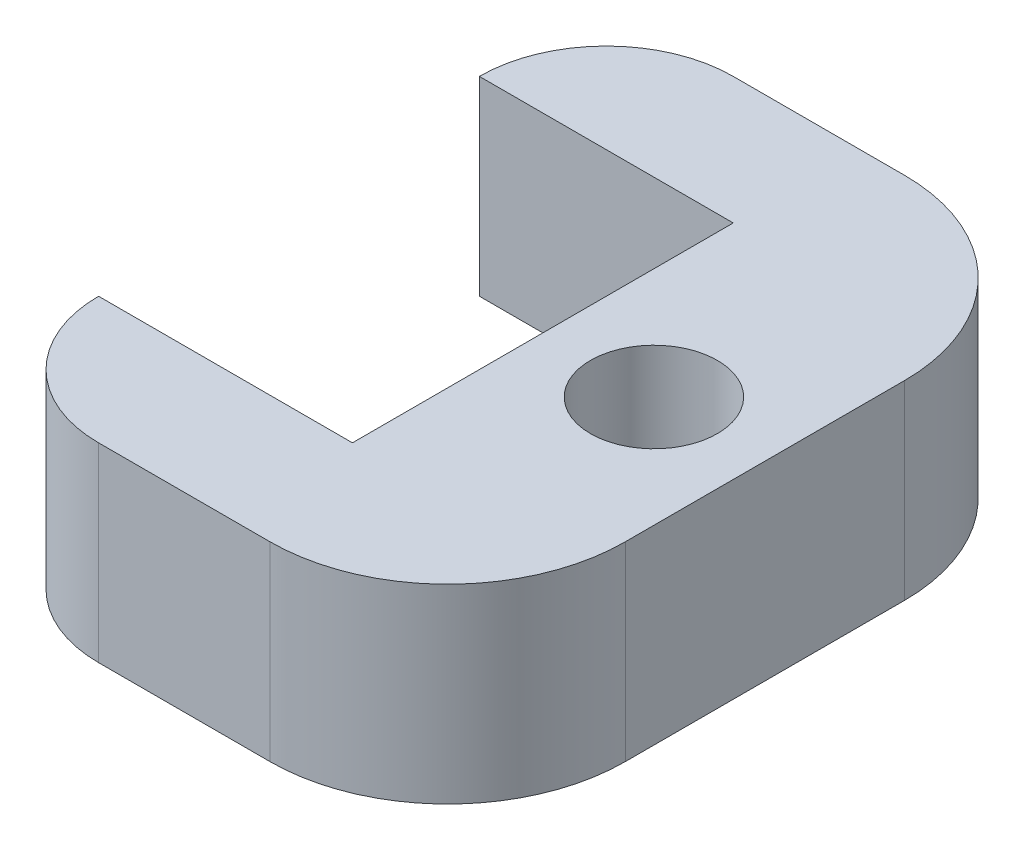
ISO-10303-21;
HEADER;
FILE_DESCRIPTION(('STEP AP214'),'2;1');
FILE_NAME('part.step','',(''),(''),'','','');
FILE_SCHEMA(('AUTOMOTIVE_DESIGN { 1 0 10303 214 1 1 1 1 }'));
ENDSEC;
DATA;
#1=APPLICATION_CONTEXT('core data for automotive mechanical design processes');
#2=APPLICATION_PROTOCOL_DEFINITION('international standard','automotive_design',2000,#1);
#3=PRODUCT_CONTEXT('',#1,'mechanical');
#4=PRODUCT('Part','Part','',(#3));
#5=PRODUCT_RELATED_PRODUCT_CATEGORY('part','',(#4));
#6=PRODUCT_DEFINITION_FORMATION('','',#4);
#7=PRODUCT_DEFINITION_CONTEXT('part definition',#1,'design');
#8=PRODUCT_DEFINITION('design','',#6,#7);
#9=PRODUCT_DEFINITION_SHAPE('','',#8);
#10=(LENGTH_UNIT() NAMED_UNIT(*) SI_UNIT(.MILLI.,.METRE.));
#11=(NAMED_UNIT(*) PLANE_ANGLE_UNIT() SI_UNIT($,.RADIAN.));
#12=(NAMED_UNIT(*) SI_UNIT($,.STERADIAN.) SOLID_ANGLE_UNIT());
#13=UNCERTAINTY_MEASURE_WITH_UNIT(LENGTH_MEASURE(1.E-05),#10,'distance_accuracy_value','');
#14=(GEOMETRIC_REPRESENTATION_CONTEXT(3) GLOBAL_UNCERTAINTY_ASSIGNED_CONTEXT((#13)) GLOBAL_UNIT_ASSIGNED_CONTEXT((#10,
#11,#12)) REPRESENTATION_CONTEXT('',''));
#15=CARTESIAN_POINT('',(0.,0.,0.));
#16=DIRECTION('',(0.,0.,1.));
#17=DIRECTION('',(1.,0.,0.));
#18=AXIS2_PLACEMENT_3D('',#15,#16,#17);
#19=CARTESIAN_POINT('',(-25.4,38.1,-38.1));
#20=DIRECTION('',(0.,-1.,0.));
#21=DIRECTION('',(0.,0.,-1.));
#22=AXIS2_PLACEMENT_3D('',#19,#20,#21);
#23=PLANE('',#22);
#24=DIRECTION('',(1.,0.,0.));
#25=VECTOR('',#24,1.);
#26=CARTESIAN_POINT('',(0.,38.1,-38.1));
#27=LINE('',#26,#25);
#28=CARTESIAN_POINT('',(-50.8,38.1,-38.1));
#29=VERTEX_POINT('',#28);
#30=CARTESIAN_POINT('',(0.,38.1,-38.1));
#31=VERTEX_POINT('',#30);
#32=EDGE_CURVE('E169',#29,#31,#27,.T.);
#33=ORIENTED_EDGE('',*,*,#32,.T.);
#34=DIRECTION('',(0.,0.,1.));
#35=VECTOR('',#34,1.);
#36=CARTESIAN_POINT('',(0.,38.1,38.1));
#37=LINE('',#36,#35);
#38=CARTESIAN_POINT('',(0.,38.1,38.1));
#39=VERTEX_POINT('',#38);
#40=EDGE_CURVE('E107',#31,#39,#37,.T.);
#41=ORIENTED_EDGE('',*,*,#40,.T.);
#42=DIRECTION('',(-1.,0.,0.));
#43=VECTOR('',#42,1.);
#44=CARTESIAN_POINT('',(0.,38.1,38.1));
#45=LINE('',#44,#43);
#46=CARTESIAN_POINT('',(-50.8,38.1,38.1));
#47=VERTEX_POINT('',#46);
#48=EDGE_CURVE('E190',#39,#47,#45,.T.);
#49=ORIENTED_EDGE('',*,*,#48,.T.);
#50=CARTESIAN_POINT('',(-25.4,38.1,38.1));
#51=DIRECTION('',(0.,1.,0.));
#52=DIRECTION('',(0.,0.,1.));
#53=AXIS2_PLACEMENT_3D('',#50,#51,#52);
#54=CIRCLE('',#53,25.4);
#55=CARTESIAN_POINT('',(-25.4,38.1,63.5));
#56=VERTEX_POINT('',#55);
#57=EDGE_CURVE('E209',#47,#56,#54,.T.);
#58=ORIENTED_EDGE('',*,*,#57,.T.);
#59=DIRECTION('',(1.,0.,0.));
#60=VECTOR('',#59,1.);
#61=CARTESIAN_POINT('',(-25.4,38.1,63.5));
#62=LINE('',#61,#60);
#63=CARTESIAN_POINT('',(8.88999999999975,38.1,63.5));
#64=VERTEX_POINT('',#63);
#65=EDGE_CURVE('E206',#56,#64,#62,.T.);
#66=ORIENTED_EDGE('',*,*,#65,.T.);
#67=CARTESIAN_POINT('',(8.89000000000001,38.1,27.94));
#68=DIRECTION('',(0.,1.,0.));
#69=DIRECTION('',(0.,0.,1.));
#70=AXIS2_PLACEMENT_3D('',#67,#68,#69);
#71=CIRCLE('',#70,35.56);
#72=CARTESIAN_POINT('',(44.45,38.1,27.9399999999998));
#73=VERTEX_POINT('',#72);
#74=EDGE_CURVE('E208',#64,#73,#71,.T.);
#75=ORIENTED_EDGE('',*,*,#74,.T.);
#76=DIRECTION('',(0.,0.,-1.));
#77=VECTOR('',#76,1.);
#78=CARTESIAN_POINT('',(44.45,38.1,-27.9399999999997));
#79=LINE('',#78,#77);
#80=CARTESIAN_POINT('',(44.45,38.1,-27.9399999999997));
#81=VERTEX_POINT('',#80);
#82=EDGE_CURVE('E132',#73,#81,#79,.T.);
#83=ORIENTED_EDGE('',*,*,#82,.T.);
#84=CARTESIAN_POINT('',(8.89000000000001,38.1,-27.94));
#85=DIRECTION('',(0.,1.,0.));
#86=DIRECTION('',(0.,0.,-1.));
#87=AXIS2_PLACEMENT_3D('',#84,#85,#86);
#88=CIRCLE('',#87,35.56);
#89=CARTESIAN_POINT('',(8.88999999999976,38.1,-63.5));
#90=VERTEX_POINT('',#89);
#91=EDGE_CURVE('E126',#81,#90,#88,.T.);
#92=ORIENTED_EDGE('',*,*,#91,.T.);
#93=DIRECTION('',(-1.,0.,0.));
#94=VECTOR('',#93,1.);
#95=CARTESIAN_POINT('',(-25.4,38.1,-63.5));
#96=LINE('',#95,#94);
#97=CARTESIAN_POINT('',(-25.4,38.1,-63.5));
#98=VERTEX_POINT('',#97);
#99=EDGE_CURVE('E130',#90,#98,#96,.T.);
#100=ORIENTED_EDGE('',*,*,#99,.T.);
#101=CARTESIAN_POINT('',(-25.4,38.1,-38.1));
#102=DIRECTION('',(0.,1.,0.));
#103=DIRECTION('',(0.,0.,-1.));
#104=AXIS2_PLACEMENT_3D('',#101,#102,#103);
#105=CIRCLE('',#104,25.4);
#106=EDGE_CURVE('E58',#98,#29,#105,.T.);
#107=ORIENTED_EDGE('',*,*,#106,.T.);
#108=EDGE_LOOP('',(#33,#41,#49,#58,#66,#75,#83,#92,#100,#107));
#109=FACE_BOUND('',#108,.T.);
#110=CARTESIAN_POINT('',(22.225,38.1,0.));
#111=DIRECTION('',(0.,1.,0.));
#112=DIRECTION('',(0.,0.,1.));
#113=AXIS2_PLACEMENT_3D('',#110,#111,#112);
#114=CIRCLE('',#113,12.7);
#115=CARTESIAN_POINT('',(22.225,38.1,12.7));
#116=VERTEX_POINT('',#115);
#117=EDGE_CURVE('E154',#116,#116,#114,.T.);
#118=ORIENTED_EDGE('',*,*,#117,.F.);
#119=EDGE_LOOP('',(#118));
#120=FACE_BOUND('',#119,.T.);
#121=ADVANCED_FACE('F41',(#109,#120),#23,.F.);
#122=CARTESIAN_POINT('',(-25.4,0.,-38.1));
#123=DIRECTION('',(0.,-1.,0.));
#124=DIRECTION('',(0.,0.,-1.));
#125=AXIS2_PLACEMENT_3D('',#122,#123,#124);
#126=PLANE('',#125);
#127=DIRECTION('',(1.,0.,0.));
#128=VECTOR('',#127,1.);
#129=CARTESIAN_POINT('',(0.,0.,-38.1));
#130=LINE('',#129,#128);
#131=CARTESIAN_POINT('',(-50.8,0.,-38.1));
#132=VERTEX_POINT('',#131);
#133=CARTESIAN_POINT('',(0.,0.,-38.1));
#134=VERTEX_POINT('',#133);
#135=EDGE_CURVE('E150',#132,#134,#130,.T.);
#136=ORIENTED_EDGE('',*,*,#135,.F.);
#137=CARTESIAN_POINT('',(-25.4,0.,-38.1));
#138=DIRECTION('',(0.,1.,0.));
#139=DIRECTION('',(0.,0.,-1.));
#140=AXIS2_PLACEMENT_3D('',#137,#138,#139);
#141=CIRCLE('',#140,25.4);
#142=CARTESIAN_POINT('',(-25.4,0.,-63.5));
#143=VERTEX_POINT('',#142);
#144=EDGE_CURVE('E99',#143,#132,#141,.T.);
#145=ORIENTED_EDGE('',*,*,#144,.F.);
#146=DIRECTION('',(-1.,0.,0.));
#147=VECTOR('',#146,1.);
#148=CARTESIAN_POINT('',(-25.4,0.,-63.5));
#149=LINE('',#148,#147);
#150=CARTESIAN_POINT('',(8.88999999999976,0.,-63.5));
#151=VERTEX_POINT('',#150);
#152=EDGE_CURVE('E93',#151,#143,#149,.T.);
#153=ORIENTED_EDGE('',*,*,#152,.F.);
#154=CARTESIAN_POINT('',(8.89000000000001,0.,-27.94));
#155=DIRECTION('',(0.,1.,0.));
#156=DIRECTION('',(0.,0.,-1.));
#157=AXIS2_PLACEMENT_3D('',#154,#155,#156);
#158=CIRCLE('',#157,35.56);
#159=CARTESIAN_POINT('',(44.45,0.,-27.9399999999997));
#160=VERTEX_POINT('',#159);
#161=EDGE_CURVE('E140',#160,#151,#158,.T.);
#162=ORIENTED_EDGE('',*,*,#161,.F.);
#163=DIRECTION('',(0.,0.,-1.));
#164=VECTOR('',#163,1.);
#165=CARTESIAN_POINT('',(44.45,0.,-27.9399999999997));
#166=LINE('',#165,#164);
#167=CARTESIAN_POINT('',(44.45,0.,27.9399999999998));
#168=VERTEX_POINT('',#167);
#169=EDGE_CURVE('E164',#168,#160,#166,.T.);
#170=ORIENTED_EDGE('',*,*,#169,.F.);
#171=CARTESIAN_POINT('',(8.89000000000001,0.,27.94));
#172=DIRECTION('',(0.,1.,0.));
#173=DIRECTION('',(0.,0.,1.));
#174=AXIS2_PLACEMENT_3D('',#171,#172,#173);
#175=CIRCLE('',#174,35.56);
#176=CARTESIAN_POINT('',(8.88999999999975,0.,63.5));
#177=VERTEX_POINT('',#176);
#178=EDGE_CURVE('E162',#177,#168,#175,.T.);
#179=ORIENTED_EDGE('',*,*,#178,.F.);
#180=DIRECTION('',(1.,0.,0.));
#181=VECTOR('',#180,1.);
#182=CARTESIAN_POINT('',(-25.4,0.,63.5));
#183=LINE('',#182,#181);
#184=CARTESIAN_POINT('',(-25.4,0.,63.5));
#185=VERTEX_POINT('',#184);
#186=EDGE_CURVE('E160',#185,#177,#183,.T.);
#187=ORIENTED_EDGE('',*,*,#186,.F.);
#188=CARTESIAN_POINT('',(-25.4,0.,38.1));
#189=DIRECTION('',(0.,1.,0.));
#190=DIRECTION('',(0.,0.,1.));
#191=AXIS2_PLACEMENT_3D('',#188,#189,#190);
#192=CIRCLE('',#191,25.4);
#193=CARTESIAN_POINT('',(-50.8,0.,38.1));
#194=VERTEX_POINT('',#193);
#195=EDGE_CURVE('E158',#194,#185,#192,.T.);
#196=ORIENTED_EDGE('',*,*,#195,.F.);
#197=DIRECTION('',(-1.,0.,0.));
#198=VECTOR('',#197,1.);
#199=CARTESIAN_POINT('',(0.,0.,38.1));
#200=LINE('',#199,#198);
#201=CARTESIAN_POINT('',(0.,0.,38.1));
#202=VERTEX_POINT('',#201);
#203=EDGE_CURVE('E156',#202,#194,#200,.T.);
#204=ORIENTED_EDGE('',*,*,#203,.F.);
#205=DIRECTION('',(0.,0.,1.));
#206=VECTOR('',#205,1.);
#207=CARTESIAN_POINT('',(0.,0.,38.1));
#208=LINE('',#207,#206);
#209=EDGE_CURVE('E153',#134,#202,#208,.T.);
#210=ORIENTED_EDGE('',*,*,#209,.F.);
#211=EDGE_LOOP('',(#136,#145,#153,#162,#170,#179,#187,#196,#204,#210));
#212=FACE_BOUND('',#211,.T.);
#213=CARTESIAN_POINT('',(22.225,0.,0.));
#214=DIRECTION('',(0.,1.,0.));
#215=DIRECTION('',(0.,0.,1.));
#216=AXIS2_PLACEMENT_3D('',#213,#214,#215);
#217=CIRCLE('',#216,12.7);
#218=CARTESIAN_POINT('',(22.225,0.,12.7));
#219=VERTEX_POINT('',#218);
#220=EDGE_CURVE('E217',#219,#219,#217,.T.);
#221=ORIENTED_EDGE('',*,*,#220,.T.);
#222=EDGE_LOOP('',(#221));
#223=FACE_BOUND('',#222,.T.);
#224=ADVANCED_FACE('F194',(#212,#223),#126,.T.);
#225=CARTESIAN_POINT('',(0.,38.1,-38.1));
#226=DIRECTION('',(0.,0.,-1.));
#227=DIRECTION('',(-1.,0.,0.));
#228=AXIS2_PLACEMENT_3D('',#225,#226,#227);
#229=PLANE('',#228);
#230=ORIENTED_EDGE('',*,*,#135,.T.);
#231=DIRECTION('',(0.,-1.,0.));
#232=VECTOR('',#231,1.);
#233=CARTESIAN_POINT('',(0.,38.1,-38.1));
#234=LINE('',#233,#232);
#235=EDGE_CURVE('E11',#31,#134,#234,.T.);
#236=ORIENTED_EDGE('',*,*,#235,.F.);
#237=ORIENTED_EDGE('',*,*,#32,.F.);
#238=DIRECTION('',(0.,-1.,0.));
#239=VECTOR('',#238,1.);
#240=CARTESIAN_POINT('',(-50.8,38.1,-38.1));
#241=LINE('',#240,#239);
#242=EDGE_CURVE('E146',#29,#132,#241,.T.);
#243=ORIENTED_EDGE('',*,*,#242,.T.);
#244=EDGE_LOOP('',(#230,#236,#237,#243));
#245=FACE_BOUND('',#244,.T.);
#246=ADVANCED_FACE('F43',(#245),#229,.F.);
#247=CARTESIAN_POINT('',(0.,38.1,38.1));
#248=DIRECTION('',(1.,0.,0.));
#249=DIRECTION('',(0.,0.,-1.));
#250=AXIS2_PLACEMENT_3D('',#247,#248,#249);
#251=PLANE('',#250);
#252=ORIENTED_EDGE('',*,*,#209,.T.);
#253=DIRECTION('',(0.,-1.,0.));
#254=VECTOR('',#253,1.);
#255=CARTESIAN_POINT('',(0.,38.1,38.1));
#256=LINE('',#255,#254);
#257=EDGE_CURVE('E50',#39,#202,#256,.T.);
#258=ORIENTED_EDGE('',*,*,#257,.F.);
#259=ORIENTED_EDGE('',*,*,#40,.F.);
#260=ORIENTED_EDGE('',*,*,#235,.T.);
#261=EDGE_LOOP('',(#252,#258,#259,#260));
#262=FACE_BOUND('',#261,.T.);
#263=ADVANCED_FACE('F253',(#262),#251,.F.);
#264=CARTESIAN_POINT('',(0.,38.1,38.1));
#265=DIRECTION('',(0.,0.,1.));
#266=DIRECTION('',(1.,0.,0.));
#267=AXIS2_PLACEMENT_3D('',#264,#265,#266);
#268=PLANE('',#267);
#269=ORIENTED_EDGE('',*,*,#203,.T.);
#270=DIRECTION('',(0.,-1.,0.));
#271=VECTOR('',#270,1.);
#272=CARTESIAN_POINT('',(-50.8,38.1,38.1));
#273=LINE('',#272,#271);
#274=EDGE_CURVE('E182',#47,#194,#273,.T.);
#275=ORIENTED_EDGE('',*,*,#274,.F.);
#276=ORIENTED_EDGE('',*,*,#48,.F.);
#277=ORIENTED_EDGE('',*,*,#257,.T.);
#278=EDGE_LOOP('',(#269,#275,#276,#277));
#279=FACE_BOUND('',#278,.T.);
#280=ADVANCED_FACE('F188',(#279),#268,.F.);
#281=CARTESIAN_POINT('',(-25.4,38.1,38.1));
#282=DIRECTION('',(0.,-1.,0.));
#283=DIRECTION('',(0.,0.,-1.));
#284=AXIS2_PLACEMENT_3D('',#281,#282,#283);
#285=CYLINDRICAL_SURFACE('',#284,25.4);
#286=ORIENTED_EDGE('',*,*,#195,.T.);
#287=DIRECTION('',(0.,-1.,0.));
#288=VECTOR('',#287,1.);
#289=CARTESIAN_POINT('',(-25.4,38.1,63.5));
#290=LINE('',#289,#288);
#291=EDGE_CURVE('E179',#56,#185,#290,.T.);
#292=ORIENTED_EDGE('',*,*,#291,.F.);
#293=ORIENTED_EDGE('',*,*,#57,.F.);
#294=ORIENTED_EDGE('',*,*,#274,.T.);
#295=EDGE_LOOP('',(#286,#292,#293,#294));
#296=FACE_BOUND('',#295,.T.);
#297=ADVANCED_FACE('F200',(#296),#285,.T.);
#298=CARTESIAN_POINT('',(-25.4,38.1,63.5));
#299=DIRECTION('',(0.,0.,-1.));
#300=DIRECTION('',(-1.,0.,0.));
#301=AXIS2_PLACEMENT_3D('',#298,#299,#300);
#302=PLANE('',#301);
#303=ORIENTED_EDGE('',*,*,#186,.T.);
#304=DIRECTION('',(0.,-1.,0.));
#305=VECTOR('',#304,1.);
#306=CARTESIAN_POINT('',(8.88999999999975,38.1,63.5));
#307=LINE('',#306,#305);
#308=EDGE_CURVE('E176',#64,#177,#307,.T.);
#309=ORIENTED_EDGE('',*,*,#308,.F.);
#310=ORIENTED_EDGE('',*,*,#65,.F.);
#311=ORIENTED_EDGE('',*,*,#291,.T.);
#312=EDGE_LOOP('',(#303,#309,#310,#311));
#313=FACE_BOUND('',#312,.T.);
#314=ADVANCED_FACE('F204',(#313),#302,.F.);
#315=CARTESIAN_POINT('',(8.89000000000001,38.1,27.94));
#316=DIRECTION('',(0.,-1.,0.));
#317=DIRECTION('',(0.,0.,-1.));
#318=AXIS2_PLACEMENT_3D('',#315,#316,#317);
#319=CYLINDRICAL_SURFACE('',#318,35.56);
#320=ORIENTED_EDGE('',*,*,#178,.T.);
#321=DIRECTION('',(0.,-1.,0.));
#322=VECTOR('',#321,1.);
#323=CARTESIAN_POINT('',(44.45,38.1,27.9399999999998));
#324=LINE('',#323,#322);
#325=EDGE_CURVE('E173',#73,#168,#324,.T.);
#326=ORIENTED_EDGE('',*,*,#325,.F.);
#327=ORIENTED_EDGE('',*,*,#74,.F.);
#328=ORIENTED_EDGE('',*,*,#308,.T.);
#329=EDGE_LOOP('',(#320,#326,#327,#328));
#330=FACE_BOUND('',#329,.T.);
#331=ADVANCED_FACE('F243',(#330),#319,.T.);
#332=CARTESIAN_POINT('',(44.45,38.1,-27.9399999999997));
#333=DIRECTION('',(-1.,0.,0.));
#334=DIRECTION('',(0.,0.,1.));
#335=AXIS2_PLACEMENT_3D('',#332,#333,#334);
#336=PLANE('',#335);
#337=ORIENTED_EDGE('',*,*,#169,.T.);
#338=DIRECTION('',(0.,-1.,0.));
#339=VECTOR('',#338,1.);
#340=CARTESIAN_POINT('',(44.45,38.1,-27.9399999999997));
#341=LINE('',#340,#339);
#342=EDGE_CURVE('E141',#81,#160,#341,.T.);
#343=ORIENTED_EDGE('',*,*,#342,.F.);
#344=ORIENTED_EDGE('',*,*,#82,.F.);
#345=ORIENTED_EDGE('',*,*,#325,.T.);
#346=EDGE_LOOP('',(#337,#343,#344,#345));
#347=FACE_BOUND('',#346,.T.);
#348=ADVANCED_FACE('F240',(#347),#336,.F.);
#349=CARTESIAN_POINT('',(8.89000000000001,38.1,-27.94));
#350=DIRECTION('',(0.,-1.,0.));
#351=DIRECTION('',(0.,0.,-1.));
#352=AXIS2_PLACEMENT_3D('',#349,#350,#351);
#353=CYLINDRICAL_SURFACE('',#352,35.56);
#354=ORIENTED_EDGE('',*,*,#161,.T.);
#355=DIRECTION('',(0.,-1.,0.));
#356=VECTOR('',#355,1.);
#357=CARTESIAN_POINT('',(8.88999999999976,38.1,-63.5));
#358=LINE('',#357,#356);
#359=EDGE_CURVE('E137',#90,#151,#358,.T.);
#360=ORIENTED_EDGE('',*,*,#359,.F.);
#361=ORIENTED_EDGE('',*,*,#91,.F.);
#362=ORIENTED_EDGE('',*,*,#342,.T.);
#363=EDGE_LOOP('',(#354,#360,#361,#362));
#364=FACE_BOUND('',#363,.T.);
#365=ADVANCED_FACE('F138',(#364),#353,.T.);
#366=CARTESIAN_POINT('',(-25.4,38.1,-63.5));
#367=DIRECTION('',(0.,0.,1.));
#368=DIRECTION('',(1.,0.,0.));
#369=AXIS2_PLACEMENT_3D('',#366,#367,#368);
#370=PLANE('',#369);
#371=ORIENTED_EDGE('',*,*,#152,.T.);
#372=DIRECTION('',(0.,-1.,0.));
#373=VECTOR('',#372,1.);
#374=CARTESIAN_POINT('',(-25.4,38.1,-63.5));
#375=LINE('',#374,#373);
#376=EDGE_CURVE('E142',#98,#143,#375,.T.);
#377=ORIENTED_EDGE('',*,*,#376,.F.);
#378=ORIENTED_EDGE('',*,*,#99,.F.);
#379=ORIENTED_EDGE('',*,*,#359,.T.);
#380=EDGE_LOOP('',(#371,#377,#378,#379));
#381=FACE_BOUND('',#380,.T.);
#382=ADVANCED_FACE('F144',(#381),#370,.F.);
#383=CARTESIAN_POINT('',(-25.4,38.1,-38.1));
#384=DIRECTION('',(0.,-1.,0.));
#385=DIRECTION('',(0.,0.,-1.));
#386=AXIS2_PLACEMENT_3D('',#383,#384,#385);
#387=CYLINDRICAL_SURFACE('',#386,25.4);
#388=ORIENTED_EDGE('',*,*,#144,.T.);
#389=ORIENTED_EDGE('',*,*,#242,.F.);
#390=ORIENTED_EDGE('',*,*,#106,.F.);
#391=ORIENTED_EDGE('',*,*,#376,.T.);
#392=EDGE_LOOP('',(#388,#389,#390,#391));
#393=FACE_BOUND('',#392,.T.);
#394=ADVANCED_FACE('F233',(#393),#387,.T.);
#395=CARTESIAN_POINT('',(22.225,38.1,0.));
#396=DIRECTION('',(0.,-1.,0.));
#397=DIRECTION('',(0.,0.,-1.));
#398=AXIS2_PLACEMENT_3D('',#395,#396,#397);
#399=CYLINDRICAL_SURFACE('',#398,12.7);
#400=ORIENTED_EDGE('',*,*,#117,.T.);
#401=EDGE_LOOP('',(#400));
#402=FACE_BOUND('',#401,.T.);
#403=ORIENTED_EDGE('',*,*,#220,.F.);
#404=EDGE_LOOP('',(#403));
#405=FACE_BOUND('',#404,.T.);
#406=ADVANCED_FACE('F223',(#402,#405),#399,.F.);
#407=CLOSED_SHELL('',(#121,#224,#246,#263,#280,#297,#314,#331,#348,#365,#382,#394,#406));
#408=MANIFOLD_SOLID_BREP('B2',#407);
#409=ADVANCED_BREP_SHAPE_REPRESENTATION('',(#18,#408),#14);
#410=SHAPE_DEFINITION_REPRESENTATION(#9,#409);
ENDSEC;
END-ISO-10303-21;
